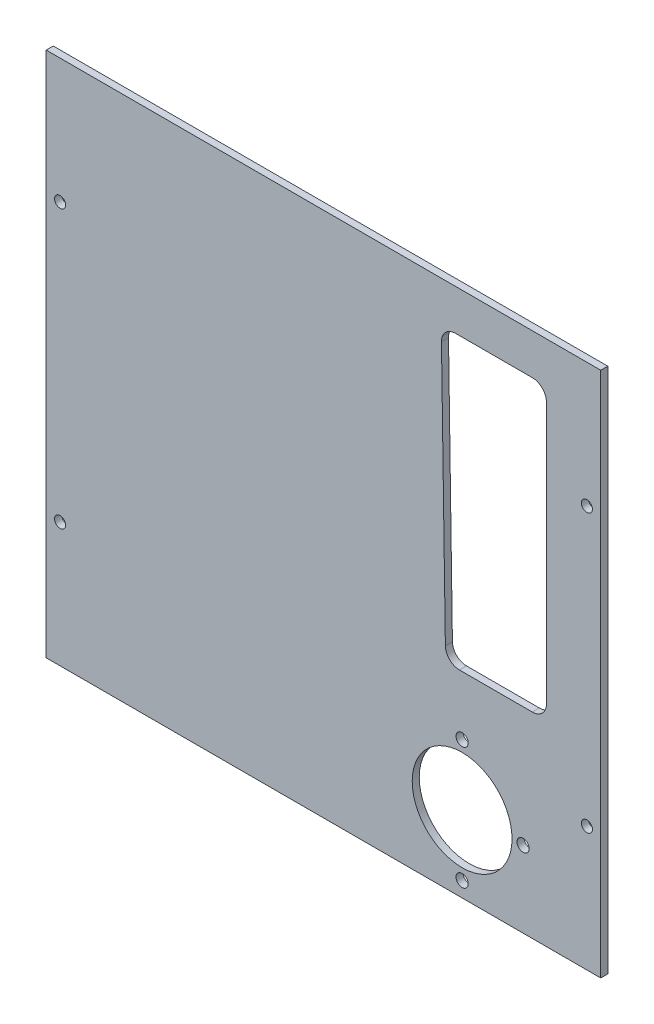
ISO-10303-21;
HEADER;
FILE_DESCRIPTION(('STEP AP214'),'2;1');
FILE_NAME('part.step','',(''),(''),'','','');
FILE_SCHEMA(('AUTOMOTIVE_DESIGN { 1 0 10303 214 1 1 1 1 }'));
ENDSEC;
DATA;
#1=APPLICATION_CONTEXT('core data for automotive mechanical design processes');
#2=APPLICATION_PROTOCOL_DEFINITION('international standard','automotive_design',2000,#1);
#3=PRODUCT_CONTEXT('',#1,'mechanical');
#4=PRODUCT('Part','Part','',(#3));
#5=PRODUCT_RELATED_PRODUCT_CATEGORY('part','',(#4));
#6=PRODUCT_DEFINITION_FORMATION('','',#4);
#7=PRODUCT_DEFINITION_CONTEXT('part definition',#1,'design');
#8=PRODUCT_DEFINITION('design','',#6,#7);
#9=PRODUCT_DEFINITION_SHAPE('','',#8);
#10=(LENGTH_UNIT() NAMED_UNIT(*) SI_UNIT(.MILLI.,.METRE.));
#11=(NAMED_UNIT(*) PLANE_ANGLE_UNIT() SI_UNIT($,.RADIAN.));
#12=(NAMED_UNIT(*) SI_UNIT($,.STERADIAN.) SOLID_ANGLE_UNIT());
#13=UNCERTAINTY_MEASURE_WITH_UNIT(LENGTH_MEASURE(1.E-05),#10,'distance_accuracy_value','');
#14=(GEOMETRIC_REPRESENTATION_CONTEXT(3) GLOBAL_UNCERTAINTY_ASSIGNED_CONTEXT((#13)) GLOBAL_UNIT_ASSIGNED_CONTEXT((#10,
#11,#12)) REPRESENTATION_CONTEXT('',''));
#15=CARTESIAN_POINT('',(0.,0.,0.));
#16=DIRECTION('',(0.,0.,1.));
#17=DIRECTION('',(1.,0.,0.));
#18=AXIS2_PLACEMENT_3D('',#15,#16,#17);
#19=CARTESIAN_POINT('',(0.,0.,1.27));
#20=DIRECTION('',(0.,0.,1.));
#21=DIRECTION('',(1.,0.,0.));
#22=AXIS2_PLACEMENT_3D('',#19,#20,#21);
#23=PLANE('',#22);
#24=CARTESIAN_POINT('',(87.6690886517043,39.177213214935,1.27));
#25=DIRECTION('',(0.,0.,1.));
#26=DIRECTION('',(-1.,0.,0.));
#27=AXIS2_PLACEMENT_3D('',#24,#25,#26);
#28=CIRCLE('',#27,2.54);
#29=CARTESIAN_POINT('',(87.6690886517043,36.637213214935,1.27));
#30=VERTEX_POINT('',#29);
#31=CARTESIAN_POINT('',(90.2090886517043,39.177213214935,1.27));
#32=VERTEX_POINT('',#31);
#33=EDGE_CURVE('E52',#30,#32,#28,.T.);
#34=ORIENTED_EDGE('',*,*,#33,.F.);
#35=DIRECTION('',(1.,0.,0.));
#36=VECTOR('',#35,1.);
#37=CARTESIAN_POINT('',(74.5208496669408,36.637213214935,1.27));
#38=LINE('',#37,#36);
#39=CARTESIAN_POINT('',(74.5208496669408,36.637213214935,1.27));
#40=VERTEX_POINT('',#39);
#41=EDGE_CURVE('E159',#40,#30,#38,.T.);
#42=ORIENTED_EDGE('',*,*,#41,.F.);
#43=CARTESIAN_POINT('',(74.5208496669408,39.177213214935,1.27));
#44=DIRECTION('',(0.,0.,1.));
#45=DIRECTION('',(-1.,0.,0.));
#46=AXIS2_PLACEMENT_3D('',#43,#44,#45);
#47=CIRCLE('',#46,2.54000000000001);
#48=CARTESIAN_POINT('',(71.9811328925016,39.1392829416404,1.27));
#49=VERTEX_POINT('',#48);
#50=EDGE_CURVE('E156',#49,#40,#47,.T.);
#51=ORIENTED_EDGE('',*,*,#50,.F.);
#52=DIRECTION('',(0.0149331784624412,-0.999888493873696,0.));
#53=VECTOR('',#52,1.);
#54=CARTESIAN_POINT('',(71.2771247580891,86.2779168877245,1.27));
#55=LINE('',#54,#53);
#56=CARTESIAN_POINT('',(71.2771247580891,86.2779168877245,1.27));
#57=VERTEX_POINT('',#56);
#58=EDGE_CURVE('E153',#57,#49,#55,.T.);
#59=ORIENTED_EDGE('',*,*,#58,.F.);
#60=CARTESIAN_POINT('',(73.8168415325282,86.3158471610191,1.27));
#61=DIRECTION('',(0.,0.,1.));
#62=DIRECTION('',(1.,0.,0.));
#63=AXIS2_PLACEMENT_3D('',#60,#61,#62);
#64=CIRCLE('',#63,2.53999999999999);
#65=CARTESIAN_POINT('',(73.8168415325283,88.8558471610191,1.27));
#66=VERTEX_POINT('',#65);
#67=EDGE_CURVE('E147',#66,#57,#64,.T.);
#68=ORIENTED_EDGE('',*,*,#67,.F.);
#69=DIRECTION('',(-1.,0.,0.));
#70=VECTOR('',#69,1.);
#71=CARTESIAN_POINT('',(87.6690886517046,88.8558471610191,1.27));
#72=LINE('',#71,#70);
#73=CARTESIAN_POINT('',(87.6690886517046,88.8558471610191,1.27));
#74=VERTEX_POINT('',#73);
#75=EDGE_CURVE('E145',#74,#66,#72,.T.);
#76=ORIENTED_EDGE('',*,*,#75,.F.);
#77=CARTESIAN_POINT('',(87.6690886517046,86.3158471610191,1.27));
#78=DIRECTION('',(0.,0.,1.));
#79=DIRECTION('',(-1.,0.,0.));
#80=AXIS2_PLACEMENT_3D('',#77,#78,#79);
#81=CIRCLE('',#80,2.54);
#82=CARTESIAN_POINT('',(90.2090886517046,86.3158471610191,1.27));
#83=VERTEX_POINT('',#82);
#84=EDGE_CURVE('E129',#83,#74,#81,.T.);
#85=ORIENTED_EDGE('',*,*,#84,.F.);
#86=DIRECTION('',(0.,1.,0.));
#87=VECTOR('',#86,1.);
#88=CARTESIAN_POINT('',(90.2090886517043,39.177213214935,1.27));
#89=LINE('',#88,#87);
#90=EDGE_CURVE('E138',#32,#83,#89,.T.);
#91=ORIENTED_EDGE('',*,*,#90,.F.);
#92=EDGE_LOOP('',(#34,#42,#51,#59,#68,#76,#85,#91));
#93=FACE_BOUND('',#92,.T.);
#94=CARTESIAN_POINT('',(97.5,73.73,1.27));
#95=DIRECTION('',(0.,0.,1.));
#96=DIRECTION('',(1.,0.,0.));
#97=AXIS2_PLACEMENT_3D('',#94,#95,#96);
#98=CIRCLE('',#97,1.00000000000001);
#99=CARTESIAN_POINT('',(98.5,73.73,1.27));
#100=VERTEX_POINT('',#99);
#101=EDGE_CURVE('E195',#100,#100,#98,.T.);
#102=ORIENTED_EDGE('',*,*,#101,.F.);
#103=EDGE_LOOP('',(#102));
#104=FACE_BOUND('',#103,.T.);
#105=CARTESIAN_POINT('',(97.5,23.73,1.27));
#106=DIRECTION('',(0.,0.,1.));
#107=DIRECTION('',(1.,0.,0.));
#108=AXIS2_PLACEMENT_3D('',#105,#106,#107);
#109=CIRCLE('',#108,0.999999999999998);
#110=CARTESIAN_POINT('',(98.5,23.73,1.27));
#111=VERTEX_POINT('',#110);
#112=EDGE_CURVE('E192',#111,#111,#109,.T.);
#113=ORIENTED_EDGE('',*,*,#112,.F.);
#114=EDGE_LOOP('',(#113));
#115=FACE_BOUND('',#114,.T.);
#116=CARTESIAN_POINT('',(2.49999999999999,23.73,1.27));
#117=DIRECTION('',(0.,0.,1.));
#118=DIRECTION('',(1.,0.,0.));
#119=AXIS2_PLACEMENT_3D('',#116,#117,#118);
#120=CIRCLE('',#119,0.999999999999999);
#121=CARTESIAN_POINT('',(3.49999999999999,23.73,1.27));
#122=VERTEX_POINT('',#121);
#123=EDGE_CURVE('E189',#122,#122,#120,.T.);
#124=ORIENTED_EDGE('',*,*,#123,.F.);
#125=EDGE_LOOP('',(#124));
#126=FACE_BOUND('',#125,.T.);
#127=CARTESIAN_POINT('',(2.5,73.73,1.27));
#128=DIRECTION('',(0.,0.,1.));
#129=DIRECTION('',(1.,0.,0.));
#130=AXIS2_PLACEMENT_3D('',#127,#128,#129);
#131=CIRCLE('',#130,1.);
#132=CARTESIAN_POINT('',(3.5,73.73,1.27));
#133=VERTEX_POINT('',#132);
#134=EDGE_CURVE('E186',#133,#133,#131,.T.);
#135=ORIENTED_EDGE('',*,*,#134,.F.);
#136=EDGE_LOOP('',(#135));
#137=FACE_BOUND('',#136,.T.);
#138=CARTESIAN_POINT('',(75.,15.,1.27));
#139=DIRECTION('',(0.,0.,1.));
#140=DIRECTION('',(1.,0.,0.));
#141=AXIS2_PLACEMENT_3D('',#138,#139,#140);
#142=CIRCLE('',#141,9.00000000000001);
#143=CARTESIAN_POINT('',(84.,15.,1.27));
#144=VERTEX_POINT('',#143);
#145=EDGE_CURVE('E210',#144,#144,#142,.F.);
#146=ORIENTED_EDGE('',*,*,#145,.T.);
#147=EDGE_LOOP('',(#146));
#148=FACE_BOUND('',#147,.T.);
#149=DIRECTION('',(1.,0.,0.));
#150=VECTOR('',#149,1.);
#151=CARTESIAN_POINT('',(0.,96.19,1.27));
#152=LINE('',#151,#150);
#153=CARTESIAN_POINT('',(0.,96.19,1.27));
#154=VERTEX_POINT('',#153);
#155=CARTESIAN_POINT('',(100.,96.19,1.27));
#156=VERTEX_POINT('',#155);
#157=EDGE_CURVE('E223',#154,#156,#152,.T.);
#158=ORIENTED_EDGE('',*,*,#157,.F.);
#159=DIRECTION('',(0.,1.,0.));
#160=VECTOR('',#159,1.);
#161=CARTESIAN_POINT('',(0.,0.,1.27));
#162=LINE('',#161,#160);
#163=CARTESIAN_POINT('',(0.,1.27,1.27));
#164=VERTEX_POINT('',#163);
#165=EDGE_CURVE('E226',#164,#154,#162,.T.);
#166=ORIENTED_EDGE('',*,*,#165,.F.);
#167=DIRECTION('',(1.,0.,0.));
#168=VECTOR('',#167,1.);
#169=CARTESIAN_POINT('',(0.,1.27,1.27));
#170=LINE('',#169,#168);
#171=CARTESIAN_POINT('',(100.,1.27,1.27));
#172=VERTEX_POINT('',#171);
#173=EDGE_CURVE('E230',#164,#172,#170,.T.);
#174=ORIENTED_EDGE('',*,*,#173,.T.);
#175=DIRECTION('',(0.,1.,0.));
#176=VECTOR('',#175,1.);
#177=CARTESIAN_POINT('',(100.,0.,1.27));
#178=LINE('',#177,#176);
#179=EDGE_CURVE('E232',#172,#156,#178,.T.);
#180=ORIENTED_EDGE('',*,*,#179,.T.);
#181=EDGE_LOOP('',(#158,#166,#174,#180));
#182=FACE_BOUND('',#181,.T.);
#183=CARTESIAN_POINT('',(75.,26.,1.27));
#184=DIRECTION('',(0.,0.,1.));
#185=DIRECTION('',(1.,0.,0.));
#186=AXIS2_PLACEMENT_3D('',#183,#184,#185);
#187=CIRCLE('',#186,1.1);
#188=CARTESIAN_POINT('',(76.1,26.,1.27));
#189=VERTEX_POINT('',#188);
#190=EDGE_CURVE('E213',#189,#189,#187,.T.);
#191=ORIENTED_EDGE('',*,*,#190,.F.);
#192=EDGE_LOOP('',(#191));
#193=FACE_BOUND('',#192,.T.);
#194=CARTESIAN_POINT('',(86.,15.,1.27));
#195=DIRECTION('',(0.,0.,1.));
#196=DIRECTION('',(1.,0.,0.));
#197=AXIS2_PLACEMENT_3D('',#194,#195,#196);
#198=CIRCLE('',#197,1.09999999999999);
#199=CARTESIAN_POINT('',(87.1,15.,1.27));
#200=VERTEX_POINT('',#199);
#201=EDGE_CURVE('E216',#200,#200,#198,.T.);
#202=ORIENTED_EDGE('',*,*,#201,.F.);
#203=EDGE_LOOP('',(#202));
#204=FACE_BOUND('',#203,.T.);
#205=CARTESIAN_POINT('',(75.,4.,1.27));
#206=DIRECTION('',(0.,0.,1.));
#207=DIRECTION('',(1.,0.,0.));
#208=AXIS2_PLACEMENT_3D('',#205,#206,#207);
#209=CIRCLE('',#208,1.09999999999999);
#210=CARTESIAN_POINT('',(76.1,4.,1.27));
#211=VERTEX_POINT('',#210);
#212=EDGE_CURVE('E219',#211,#211,#209,.T.);
#213=ORIENTED_EDGE('',*,*,#212,.F.);
#214=EDGE_LOOP('',(#213));
#215=FACE_BOUND('',#214,.T.);
#216=ADVANCED_FACE('F37',(#93,#104,#115,#126,#137,#148,#182,#193,#204,#215),#23,.T.);
#217=CARTESIAN_POINT('',(0.,0.,0.));
#218=DIRECTION('',(0.,0.,1.));
#219=DIRECTION('',(1.,0.,0.));
#220=AXIS2_PLACEMENT_3D('',#217,#218,#219);
#221=PLANE('',#220);
#222=DIRECTION('',(1.,0.,0.));
#223=VECTOR('',#222,1.);
#224=CARTESIAN_POINT('',(0.,36.637213214935,0.));
#225=LINE('',#224,#223);
#226=CARTESIAN_POINT('',(74.5208496669408,36.637213214935,0.));
#227=VERTEX_POINT('',#226);
#228=CARTESIAN_POINT('',(87.6690886517043,36.637213214935,0.));
#229=VERTEX_POINT('',#228);
#230=EDGE_CURVE('E45',#227,#229,#225,.T.);
#231=ORIENTED_EDGE('',*,*,#230,.T.);
#232=CARTESIAN_POINT('',(87.6690886517043,39.177213214935,0.));
#233=DIRECTION('',(0.,0.,1.));
#234=DIRECTION('',(1.,0.,0.));
#235=AXIS2_PLACEMENT_3D('',#232,#233,#234);
#236=CIRCLE('',#235,2.54);
#237=CARTESIAN_POINT('',(90.2090886517043,39.177213214935,0.));
#238=VERTEX_POINT('',#237);
#239=EDGE_CURVE('E11',#229,#238,#236,.T.);
#240=ORIENTED_EDGE('',*,*,#239,.T.);
#241=DIRECTION('',(0.,1.,0.));
#242=VECTOR('',#241,1.);
#243=CARTESIAN_POINT('',(90.2090886517041,-5.04599884024106E-13,0.));
#244=LINE('',#243,#242);
#245=CARTESIAN_POINT('',(90.2090886517046,86.3158471610191,0.));
#246=VERTEX_POINT('',#245);
#247=EDGE_CURVE('E252',#238,#246,#244,.T.);
#248=ORIENTED_EDGE('',*,*,#247,.T.);
#249=CARTESIAN_POINT('',(87.6690886517046,86.3158471610191,0.));
#250=DIRECTION('',(0.,0.,1.));
#251=DIRECTION('',(1.,0.,0.));
#252=AXIS2_PLACEMENT_3D('',#249,#250,#251);
#253=CIRCLE('',#252,2.54);
#254=CARTESIAN_POINT('',(87.6690886517046,88.8558471610191,0.));
#255=VERTEX_POINT('',#254);
#256=EDGE_CURVE('E132',#246,#255,#253,.T.);
#257=ORIENTED_EDGE('',*,*,#256,.T.);
#258=DIRECTION('',(-1.,0.,0.));
#259=VECTOR('',#258,1.);
#260=CARTESIAN_POINT('',(0.,88.8558471610191,0.));
#261=LINE('',#260,#259);
#262=CARTESIAN_POINT('',(73.8168415325283,88.8558471610191,0.));
#263=VERTEX_POINT('',#262);
#264=EDGE_CURVE('E255',#255,#263,#261,.T.);
#265=ORIENTED_EDGE('',*,*,#264,.T.);
#266=CARTESIAN_POINT('',(73.8168415325282,86.3158471610191,0.));
#267=DIRECTION('',(0.,0.,1.));
#268=DIRECTION('',(1.,0.,0.));
#269=AXIS2_PLACEMENT_3D('',#266,#267,#268);
#270=CIRCLE('',#269,2.53999999999999);
#271=CARTESIAN_POINT('',(71.2771247580891,86.2779168877245,0.));
#272=VERTEX_POINT('',#271);
#273=EDGE_CURVE('E258',#263,#272,#270,.T.);
#274=ORIENTED_EDGE('',*,*,#273,.T.);
#275=DIRECTION('',(0.0149331784624412,-0.999888493873696,0.));
#276=VECTOR('',#275,1.);
#277=CARTESIAN_POINT('',(72.5494898375351,1.08351529769661,0.));
#278=LINE('',#277,#276);
#279=CARTESIAN_POINT('',(71.9811328925016,39.1392829416404,0.));
#280=VERTEX_POINT('',#279);
#281=EDGE_CURVE('E261',#272,#280,#278,.T.);
#282=ORIENTED_EDGE('',*,*,#281,.T.);
#283=CARTESIAN_POINT('',(74.5208496669408,39.177213214935,0.));
#284=DIRECTION('',(0.,0.,1.));
#285=DIRECTION('',(1.,0.,0.));
#286=AXIS2_PLACEMENT_3D('',#283,#284,#285);
#287=CIRCLE('',#286,2.54000000000001);
#288=EDGE_CURVE('E264',#280,#227,#287,.T.);
#289=ORIENTED_EDGE('',*,*,#288,.T.);
#290=EDGE_LOOP('',(#231,#240,#248,#257,#265,#274,#282,#289));
#291=FACE_BOUND('',#290,.T.);
#292=CARTESIAN_POINT('',(97.5,73.73,0.));
#293=DIRECTION('',(0.,0.,-1.));
#294=DIRECTION('',(-1.,0.,0.));
#295=AXIS2_PLACEMENT_3D('',#292,#293,#294);
#296=CIRCLE('',#295,1.00000000000001);
#297=CARTESIAN_POINT('',(96.5,73.73,0.));
#298=VERTEX_POINT('',#297);
#299=EDGE_CURVE('E164',#298,#298,#296,.T.);
#300=ORIENTED_EDGE('',*,*,#299,.F.);
#301=EDGE_LOOP('',(#300));
#302=FACE_BOUND('',#301,.T.);
#303=CARTESIAN_POINT('',(97.5,23.73,0.));
#304=DIRECTION('',(0.,0.,-1.));
#305=DIRECTION('',(-1.,0.,0.));
#306=AXIS2_PLACEMENT_3D('',#303,#304,#305);
#307=CIRCLE('',#306,0.999999999999998);
#308=CARTESIAN_POINT('',(96.5,23.73,0.));
#309=VERTEX_POINT('',#308);
#310=EDGE_CURVE('E179',#309,#309,#307,.T.);
#311=ORIENTED_EDGE('',*,*,#310,.F.);
#312=EDGE_LOOP('',(#311));
#313=FACE_BOUND('',#312,.T.);
#314=CARTESIAN_POINT('',(2.49999999999999,23.73,0.));
#315=DIRECTION('',(0.,0.,-1.));
#316=DIRECTION('',(1.,0.,0.));
#317=AXIS2_PLACEMENT_3D('',#314,#315,#316);
#318=CIRCLE('',#317,0.999999999999999);
#319=CARTESIAN_POINT('',(3.49999999999999,23.73,0.));
#320=VERTEX_POINT('',#319);
#321=EDGE_CURVE('E175',#320,#320,#318,.T.);
#322=ORIENTED_EDGE('',*,*,#321,.F.);
#323=EDGE_LOOP('',(#322));
#324=FACE_BOUND('',#323,.T.);
#325=CARTESIAN_POINT('',(2.5,73.73,0.));
#326=DIRECTION('',(0.,0.,-1.));
#327=DIRECTION('',(1.,0.,0.));
#328=AXIS2_PLACEMENT_3D('',#325,#326,#327);
#329=CIRCLE('',#328,1.);
#330=CARTESIAN_POINT('',(3.5,73.73,0.));
#331=VERTEX_POINT('',#330);
#332=EDGE_CURVE('E178',#331,#331,#329,.T.);
#333=ORIENTED_EDGE('',*,*,#332,.F.);
#334=EDGE_LOOP('',(#333));
#335=FACE_BOUND('',#334,.T.);
#336=CARTESIAN_POINT('',(86.,15.,0.));
#337=DIRECTION('',(0.,0.,-1.));
#338=DIRECTION('',(-1.,0.,0.));
#339=AXIS2_PLACEMENT_3D('',#336,#337,#338);
#340=CIRCLE('',#339,1.09999999999999);
#341=CARTESIAN_POINT('',(84.9,15.,0.));
#342=VERTEX_POINT('',#341);
#343=EDGE_CURVE('E203',#342,#342,#340,.T.);
#344=ORIENTED_EDGE('',*,*,#343,.F.);
#345=EDGE_LOOP('',(#344));
#346=FACE_BOUND('',#345,.T.);
#347=DIRECTION('',(1.,0.,0.));
#348=VECTOR('',#347,1.);
#349=CARTESIAN_POINT('',(0.,96.19,0.));
#350=LINE('',#349,#348);
#351=CARTESIAN_POINT('',(0.,96.19,0.));
#352=VERTEX_POINT('',#351);
#353=CARTESIAN_POINT('',(100.,96.19,0.));
#354=VERTEX_POINT('',#353);
#355=EDGE_CURVE('E222',#352,#354,#350,.T.);
#356=ORIENTED_EDGE('',*,*,#355,.T.);
#357=DIRECTION('',(0.,1.,0.));
#358=VECTOR('',#357,1.);
#359=CARTESIAN_POINT('',(100.,0.,0.));
#360=LINE('',#359,#358);
#361=CARTESIAN_POINT('',(100.,1.27,0.));
#362=VERTEX_POINT('',#361);
#363=EDGE_CURVE('E227',#362,#354,#360,.T.);
#364=ORIENTED_EDGE('',*,*,#363,.F.);
#365=DIRECTION('',(1.,0.,0.));
#366=VECTOR('',#365,1.);
#367=CARTESIAN_POINT('',(0.,1.27,0.));
#368=LINE('',#367,#366);
#369=CARTESIAN_POINT('',(0.,1.27,0.));
#370=VERTEX_POINT('',#369);
#371=EDGE_CURVE('E240',#370,#362,#368,.T.);
#372=ORIENTED_EDGE('',*,*,#371,.F.);
#373=DIRECTION('',(0.,1.,0.));
#374=VECTOR('',#373,1.);
#375=CARTESIAN_POINT('',(0.,0.,0.));
#376=LINE('',#375,#374);
#377=EDGE_CURVE('E237',#370,#352,#376,.T.);
#378=ORIENTED_EDGE('',*,*,#377,.T.);
#379=EDGE_LOOP('',(#356,#364,#372,#378));
#380=FACE_BOUND('',#379,.T.);
#381=CARTESIAN_POINT('',(75.,15.,0.));
#382=DIRECTION('',(0.,0.,-1.));
#383=DIRECTION('',(-1.,0.,0.));
#384=AXIS2_PLACEMENT_3D('',#381,#382,#383);
#385=CIRCLE('',#384,9.00000000000001);
#386=CARTESIAN_POINT('',(66.,15.,0.));
#387=VERTEX_POINT('',#386);
#388=EDGE_CURVE('E202',#387,#387,#385,.F.);
#389=ORIENTED_EDGE('',*,*,#388,.T.);
#390=EDGE_LOOP('',(#389));
#391=FACE_BOUND('',#390,.T.);
#392=CARTESIAN_POINT('',(75.,26.,0.));
#393=DIRECTION('',(0.,0.,-1.));
#394=DIRECTION('',(-1.,0.,0.));
#395=AXIS2_PLACEMENT_3D('',#392,#393,#394);
#396=CIRCLE('',#395,1.1);
#397=CARTESIAN_POINT('',(73.9,26.,0.));
#398=VERTEX_POINT('',#397);
#399=EDGE_CURVE('E199',#398,#398,#396,.T.);
#400=ORIENTED_EDGE('',*,*,#399,.F.);
#401=EDGE_LOOP('',(#400));
#402=FACE_BOUND('',#401,.T.);
#403=CARTESIAN_POINT('',(75.,4.,0.));
#404=DIRECTION('',(0.,0.,-1.));
#405=DIRECTION('',(-1.,0.,0.));
#406=AXIS2_PLACEMENT_3D('',#403,#404,#405);
#407=CIRCLE('',#406,1.09999999999999);
#408=CARTESIAN_POINT('',(73.9,4.,0.));
#409=VERTEX_POINT('',#408);
#410=EDGE_CURVE('E198',#409,#409,#407,.T.);
#411=ORIENTED_EDGE('',*,*,#410,.F.);
#412=EDGE_LOOP('',(#411));
#413=FACE_BOUND('',#412,.T.);
#414=ADVANCED_FACE('F268',(#291,#302,#313,#324,#335,#346,#380,#391,#402,#413),#221,.F.);
#415=CARTESIAN_POINT('',(0.,96.19,1.27));
#416=DIRECTION('',(0.,1.,0.));
#417=DIRECTION('',(0.,0.,1.));
#418=AXIS2_PLACEMENT_3D('',#415,#416,#417);
#419=PLANE('',#418);
#420=ORIENTED_EDGE('',*,*,#355,.F.);
#421=DIRECTION('',(0.,0.,-1.));
#422=VECTOR('',#421,1.);
#423=CARTESIAN_POINT('',(0.,96.19,1.27));
#424=LINE('',#423,#422);
#425=EDGE_CURVE('E250',#154,#352,#424,.T.);
#426=ORIENTED_EDGE('',*,*,#425,.F.);
#427=ORIENTED_EDGE('',*,*,#157,.T.);
#428=DIRECTION('',(0.,0.,-1.));
#429=VECTOR('',#428,1.);
#430=CARTESIAN_POINT('',(100.,96.19,1.27));
#431=LINE('',#430,#429);
#432=EDGE_CURVE('E234',#156,#354,#431,.T.);
#433=ORIENTED_EDGE('',*,*,#432,.T.);
#434=EDGE_LOOP('',(#420,#426,#427,#433));
#435=FACE_BOUND('',#434,.T.);
#436=ADVANCED_FACE('F39',(#435),#419,.T.);
#437=CARTESIAN_POINT('',(0.,0.,1.27));
#438=DIRECTION('',(-1.,0.,0.));
#439=DIRECTION('',(0.,0.,1.));
#440=AXIS2_PLACEMENT_3D('',#437,#438,#439);
#441=PLANE('',#440);
#442=ORIENTED_EDGE('',*,*,#377,.F.);
#443=DIRECTION('',(0.,0.,-1.));
#444=VECTOR('',#443,1.);
#445=CARTESIAN_POINT('',(0.,1.27,1.27));
#446=LINE('',#445,#444);
#447=EDGE_CURVE('E248',#164,#370,#446,.T.);
#448=ORIENTED_EDGE('',*,*,#447,.F.);
#449=ORIENTED_EDGE('',*,*,#165,.T.);
#450=ORIENTED_EDGE('',*,*,#425,.T.);
#451=EDGE_LOOP('',(#442,#448,#449,#450));
#452=FACE_BOUND('',#451,.T.);
#453=ADVANCED_FACE('F318',(#452),#441,.T.);
#454=CARTESIAN_POINT('',(0.,1.27,1.27));
#455=DIRECTION('',(0.,1.,0.));
#456=DIRECTION('',(0.,0.,1.));
#457=AXIS2_PLACEMENT_3D('',#454,#455,#456);
#458=PLANE('',#457);
#459=ORIENTED_EDGE('',*,*,#371,.T.);
#460=DIRECTION('',(0.,0.,-1.));
#461=VECTOR('',#460,1.);
#462=CARTESIAN_POINT('',(100.,1.27,1.27));
#463=LINE('',#462,#461);
#464=EDGE_CURVE('E245',#172,#362,#463,.T.);
#465=ORIENTED_EDGE('',*,*,#464,.F.);
#466=ORIENTED_EDGE('',*,*,#173,.F.);
#467=ORIENTED_EDGE('',*,*,#447,.T.);
#468=EDGE_LOOP('',(#459,#465,#466,#467));
#469=FACE_BOUND('',#468,.T.);
#470=ADVANCED_FACE('F315',(#469),#458,.F.);
#471=CARTESIAN_POINT('',(100.,0.,1.27));
#472=DIRECTION('',(-1.,0.,0.));
#473=DIRECTION('',(0.,0.,1.));
#474=AXIS2_PLACEMENT_3D('',#471,#472,#473);
#475=PLANE('',#474);
#476=ORIENTED_EDGE('',*,*,#363,.T.);
#477=ORIENTED_EDGE('',*,*,#432,.F.);
#478=ORIENTED_EDGE('',*,*,#179,.F.);
#479=ORIENTED_EDGE('',*,*,#464,.T.);
#480=EDGE_LOOP('',(#476,#477,#478,#479));
#481=FACE_BOUND('',#480,.T.);
#482=ADVANCED_FACE('F312',(#481),#475,.F.);
#483=CARTESIAN_POINT('',(75.,15.,5.));
#484=DIRECTION('',(0.,0.,-1.));
#485=DIRECTION('',(-1.,0.,0.));
#486=AXIS2_PLACEMENT_3D('',#483,#484,#485);
#487=CYLINDRICAL_SURFACE('',#486,9.00000000000001);
#488=ORIENTED_EDGE('',*,*,#145,.F.);
#489=EDGE_LOOP('',(#488));
#490=FACE_BOUND('',#489,.T.);
#491=ORIENTED_EDGE('',*,*,#388,.F.);
#492=EDGE_LOOP('',(#491));
#493=FACE_BOUND('',#492,.T.);
#494=ADVANCED_FACE('F309',(#490,#493),#487,.F.);
#495=CARTESIAN_POINT('',(75.,26.,5.));
#496=DIRECTION('',(0.,0.,-1.));
#497=DIRECTION('',(-1.,0.,0.));
#498=AXIS2_PLACEMENT_3D('',#495,#496,#497);
#499=CYLINDRICAL_SURFACE('',#498,1.1);
#500=ORIENTED_EDGE('',*,*,#190,.T.);
#501=EDGE_LOOP('',(#500));
#502=FACE_BOUND('',#501,.T.);
#503=ORIENTED_EDGE('',*,*,#399,.T.);
#504=EDGE_LOOP('',(#503));
#505=FACE_BOUND('',#504,.T.);
#506=ADVANCED_FACE('F360',(#502,#505),#499,.F.);
#507=CARTESIAN_POINT('',(86.,15.,5.));
#508=DIRECTION('',(0.,0.,-1.));
#509=DIRECTION('',(-1.,0.,0.));
#510=AXIS2_PLACEMENT_3D('',#507,#508,#509);
#511=CYLINDRICAL_SURFACE('',#510,1.09999999999999);
#512=ORIENTED_EDGE('',*,*,#201,.T.);
#513=EDGE_LOOP('',(#512));
#514=FACE_BOUND('',#513,.T.);
#515=ORIENTED_EDGE('',*,*,#343,.T.);
#516=EDGE_LOOP('',(#515));
#517=FACE_BOUND('',#516,.T.);
#518=ADVANCED_FACE('F350',(#514,#517),#511,.F.);
#519=CARTESIAN_POINT('',(75.,4.,5.));
#520=DIRECTION('',(0.,0.,-1.));
#521=DIRECTION('',(-1.,0.,0.));
#522=AXIS2_PLACEMENT_3D('',#519,#520,#521);
#523=CYLINDRICAL_SURFACE('',#522,1.09999999999999);
#524=ORIENTED_EDGE('',*,*,#212,.T.);
#525=EDGE_LOOP('',(#524));
#526=FACE_BOUND('',#525,.T.);
#527=ORIENTED_EDGE('',*,*,#410,.T.);
#528=EDGE_LOOP('',(#527));
#529=FACE_BOUND('',#528,.T.);
#530=ADVANCED_FACE('F346',(#526,#529),#523,.F.);
#531=CARTESIAN_POINT('',(2.5,73.73,10.));
#532=DIRECTION('',(0.,0.,-1.));
#533=DIRECTION('',(-1.,0.,0.));
#534=AXIS2_PLACEMENT_3D('',#531,#532,#533);
#535=CYLINDRICAL_SURFACE('',#534,1.);
#536=ORIENTED_EDGE('',*,*,#134,.T.);
#537=EDGE_LOOP('',(#536));
#538=FACE_BOUND('',#537,.T.);
#539=ORIENTED_EDGE('',*,*,#332,.T.);
#540=EDGE_LOOP('',(#539));
#541=FACE_BOUND('',#540,.T.);
#542=ADVANCED_FACE('F349',(#538,#541),#535,.F.);
#543=CARTESIAN_POINT('',(2.49999999999999,23.73,10.));
#544=DIRECTION('',(0.,0.,-1.));
#545=DIRECTION('',(-1.,0.,0.));
#546=AXIS2_PLACEMENT_3D('',#543,#544,#545);
#547=CYLINDRICAL_SURFACE('',#546,0.999999999999999);
#548=ORIENTED_EDGE('',*,*,#123,.T.);
#549=EDGE_LOOP('',(#548));
#550=FACE_BOUND('',#549,.T.);
#551=ORIENTED_EDGE('',*,*,#321,.T.);
#552=EDGE_LOOP('',(#551));
#553=FACE_BOUND('',#552,.T.);
#554=ADVANCED_FACE('F357',(#550,#553),#547,.F.);
#555=CARTESIAN_POINT('',(97.5,23.73,10.));
#556=DIRECTION('',(0.,0.,-1.));
#557=DIRECTION('',(-1.,0.,0.));
#558=AXIS2_PLACEMENT_3D('',#555,#556,#557);
#559=CYLINDRICAL_SURFACE('',#558,0.999999999999998);
#560=ORIENTED_EDGE('',*,*,#112,.T.);
#561=EDGE_LOOP('',(#560));
#562=FACE_BOUND('',#561,.T.);
#563=ORIENTED_EDGE('',*,*,#310,.T.);
#564=EDGE_LOOP('',(#563));
#565=FACE_BOUND('',#564,.T.);
#566=ADVANCED_FACE('F297',(#562,#565),#559,.F.);
#567=CARTESIAN_POINT('',(97.5,73.73,10.));
#568=DIRECTION('',(0.,0.,-1.));
#569=DIRECTION('',(-1.,0.,0.));
#570=AXIS2_PLACEMENT_3D('',#567,#568,#569);
#571=CYLINDRICAL_SURFACE('',#570,1.00000000000001);
#572=ORIENTED_EDGE('',*,*,#101,.T.);
#573=EDGE_LOOP('',(#572));
#574=FACE_BOUND('',#573,.T.);
#575=ORIENTED_EDGE('',*,*,#299,.T.);
#576=EDGE_LOOP('',(#575));
#577=FACE_BOUND('',#576,.T.);
#578=ADVANCED_FACE('F290',(#574,#577),#571,.F.);
#579=CARTESIAN_POINT('',(87.6690886517043,39.177213214935,-1.27));
#580=DIRECTION('',(0.,0.,1.));
#581=DIRECTION('',(1.,0.,0.));
#582=AXIS2_PLACEMENT_3D('',#579,#580,#581);
#583=CYLINDRICAL_SURFACE('',#582,2.54);
#584=DIRECTION('',(0.,0.,1.));
#585=VECTOR('',#584,1.);
#586=CARTESIAN_POINT('',(87.6690886517043,36.637213214935,-1.27));
#587=LINE('',#586,#585);
#588=EDGE_CURVE('E162',#229,#30,#587,.T.);
#589=ORIENTED_EDGE('',*,*,#588,.T.);
#590=ORIENTED_EDGE('',*,*,#33,.T.);
#591=DIRECTION('',(0.,0.,1.));
#592=VECTOR('',#591,1.);
#593=CARTESIAN_POINT('',(90.2090886517043,39.177213214935,-1.27));
#594=LINE('',#593,#592);
#595=EDGE_CURVE('E135',#238,#32,#594,.T.);
#596=ORIENTED_EDGE('',*,*,#595,.F.);
#597=ORIENTED_EDGE('',*,*,#239,.F.);
#598=EDGE_LOOP('',(#589,#590,#596,#597));
#599=FACE_BOUND('',#598,.T.);
#600=ADVANCED_FACE('F288',(#599),#583,.F.);
#601=CARTESIAN_POINT('',(74.5208496669408,36.637213214935,-1.27));
#602=DIRECTION('',(0.,-1.,0.));
#603=DIRECTION('',(0.,0.,-1.));
#604=AXIS2_PLACEMENT_3D('',#601,#602,#603);
#605=PLANE('',#604);
#606=DIRECTION('',(0.,0.,1.));
#607=VECTOR('',#606,1.);
#608=CARTESIAN_POINT('',(74.5208496669408,36.637213214935,-1.27));
#609=LINE('',#608,#607);
#610=EDGE_CURVE('E165',#227,#40,#609,.T.);
#611=ORIENTED_EDGE('',*,*,#610,.T.);
#612=ORIENTED_EDGE('',*,*,#41,.T.);
#613=ORIENTED_EDGE('',*,*,#588,.F.);
#614=ORIENTED_EDGE('',*,*,#230,.F.);
#615=EDGE_LOOP('',(#611,#612,#613,#614));
#616=FACE_BOUND('',#615,.T.);
#617=ADVANCED_FACE('F273',(#616),#605,.F.);
#618=CARTESIAN_POINT('',(74.5208496669408,39.177213214935,-1.27));
#619=DIRECTION('',(0.,0.,1.));
#620=DIRECTION('',(1.,0.,0.));
#621=AXIS2_PLACEMENT_3D('',#618,#619,#620);
#622=CYLINDRICAL_SURFACE('',#621,2.54000000000001);
#623=DIRECTION('',(0.,0.,1.));
#624=VECTOR('',#623,1.);
#625=CARTESIAN_POINT('',(71.9811328925016,39.1392829416404,-1.27));
#626=LINE('',#625,#624);
#627=EDGE_CURVE('E167',#280,#49,#626,.T.);
#628=ORIENTED_EDGE('',*,*,#627,.T.);
#629=ORIENTED_EDGE('',*,*,#50,.T.);
#630=ORIENTED_EDGE('',*,*,#610,.F.);
#631=ORIENTED_EDGE('',*,*,#288,.F.);
#632=EDGE_LOOP('',(#628,#629,#630,#631));
#633=FACE_BOUND('',#632,.T.);
#634=ADVANCED_FACE('F275',(#633),#622,.F.);
#635=CARTESIAN_POINT('',(71.2771247580891,86.2779168877245,-1.27));
#636=DIRECTION('',(-0.999888493873696,-0.0149331784624412,0.));
#637=DIRECTION('',(0.0149331784624412,-0.999888493873696,0.));
#638=AXIS2_PLACEMENT_3D('',#635,#636,#637);
#639=PLANE('',#638);
#640=DIRECTION('',(0.,0.,1.));
#641=VECTOR('',#640,1.);
#642=CARTESIAN_POINT('',(71.2771247580891,86.2779168877245,-1.27));
#643=LINE('',#642,#641);
#644=EDGE_CURVE('E169',#272,#57,#643,.T.);
#645=ORIENTED_EDGE('',*,*,#644,.T.);
#646=ORIENTED_EDGE('',*,*,#58,.T.);
#647=ORIENTED_EDGE('',*,*,#627,.F.);
#648=ORIENTED_EDGE('',*,*,#281,.F.);
#649=EDGE_LOOP('',(#645,#646,#647,#648));
#650=FACE_BOUND('',#649,.T.);
#651=ADVANCED_FACE('F281',(#650),#639,.F.);
#652=CARTESIAN_POINT('',(73.8168415325282,86.3158471610191,-1.27));
#653=DIRECTION('',(0.,0.,1.));
#654=DIRECTION('',(1.,0.,0.));
#655=AXIS2_PLACEMENT_3D('',#652,#653,#654);
#656=CYLINDRICAL_SURFACE('',#655,2.53999999999999);
#657=DIRECTION('',(0.,0.,1.));
#658=VECTOR('',#657,1.);
#659=CARTESIAN_POINT('',(73.8168415325283,88.8558471610191,-1.27));
#660=LINE('',#659,#658);
#661=EDGE_CURVE('E171',#263,#66,#660,.T.);
#662=ORIENTED_EDGE('',*,*,#661,.T.);
#663=ORIENTED_EDGE('',*,*,#67,.T.);
#664=ORIENTED_EDGE('',*,*,#644,.F.);
#665=ORIENTED_EDGE('',*,*,#273,.F.);
#666=EDGE_LOOP('',(#662,#663,#664,#665));
#667=FACE_BOUND('',#666,.T.);
#668=ADVANCED_FACE('F284',(#667),#656,.F.);
#669=CARTESIAN_POINT('',(87.6690886517046,88.8558471610191,-1.27));
#670=DIRECTION('',(0.,1.,0.));
#671=DIRECTION('',(0.,0.,1.));
#672=AXIS2_PLACEMENT_3D('',#669,#670,#671);
#673=PLANE('',#672);
#674=DIRECTION('',(0.,0.,1.));
#675=VECTOR('',#674,1.);
#676=CARTESIAN_POINT('',(87.6690886517046,88.8558471610191,-1.27));
#677=LINE('',#676,#675);
#678=EDGE_CURVE('E134',#255,#74,#677,.T.);
#679=ORIENTED_EDGE('',*,*,#678,.T.);
#680=ORIENTED_EDGE('',*,*,#75,.T.);
#681=ORIENTED_EDGE('',*,*,#661,.F.);
#682=ORIENTED_EDGE('',*,*,#264,.F.);
#683=EDGE_LOOP('',(#679,#680,#681,#682));
#684=FACE_BOUND('',#683,.T.);
#685=ADVANCED_FACE('F287',(#684),#673,.F.);
#686=CARTESIAN_POINT('',(87.6690886517046,86.3158471610191,-1.27));
#687=DIRECTION('',(0.,0.,1.));
#688=DIRECTION('',(1.,0.,0.));
#689=AXIS2_PLACEMENT_3D('',#686,#687,#688);
#690=CYLINDRICAL_SURFACE('',#689,2.54);
#691=DIRECTION('',(0.,0.,1.));
#692=VECTOR('',#691,1.);
#693=CARTESIAN_POINT('',(90.2090886517046,86.3158471610191,-1.27));
#694=LINE('',#693,#692);
#695=EDGE_CURVE('E60',#246,#83,#694,.T.);
#696=ORIENTED_EDGE('',*,*,#695,.T.);
#697=ORIENTED_EDGE('',*,*,#84,.T.);
#698=ORIENTED_EDGE('',*,*,#678,.F.);
#699=ORIENTED_EDGE('',*,*,#256,.F.);
#700=EDGE_LOOP('',(#696,#697,#698,#699));
#701=FACE_BOUND('',#700,.T.);
#702=ADVANCED_FACE('F126',(#701),#690,.F.);
#703=CARTESIAN_POINT('',(90.2090886517043,39.177213214935,-1.27));
#704=DIRECTION('',(1.,0.,0.));
#705=DIRECTION('',(0.,1.,0.));
#706=AXIS2_PLACEMENT_3D('',#703,#704,#705);
#707=PLANE('',#706);
#708=ORIENTED_EDGE('',*,*,#595,.T.);
#709=ORIENTED_EDGE('',*,*,#90,.T.);
#710=ORIENTED_EDGE('',*,*,#695,.F.);
#711=ORIENTED_EDGE('',*,*,#247,.F.);
#712=EDGE_LOOP('',(#708,#709,#710,#711));
#713=FACE_BOUND('',#712,.T.);
#714=ADVANCED_FACE('F139',(#713),#707,.F.);
#715=CLOSED_SHELL('',(#216,#414,#436,#453,#470,#482,#494,#506,#518,#530,#542,#554,#566,#578,
#600,#617,#634,#651,#668,#685,#702,#714));
#716=MANIFOLD_SOLID_BREP('B2',#715);
#717=ADVANCED_BREP_SHAPE_REPRESENTATION('',(#18,#716),#14);
#718=SHAPE_DEFINITION_REPRESENTATION(#9,#717);
ENDSEC;
END-ISO-10303-21;
